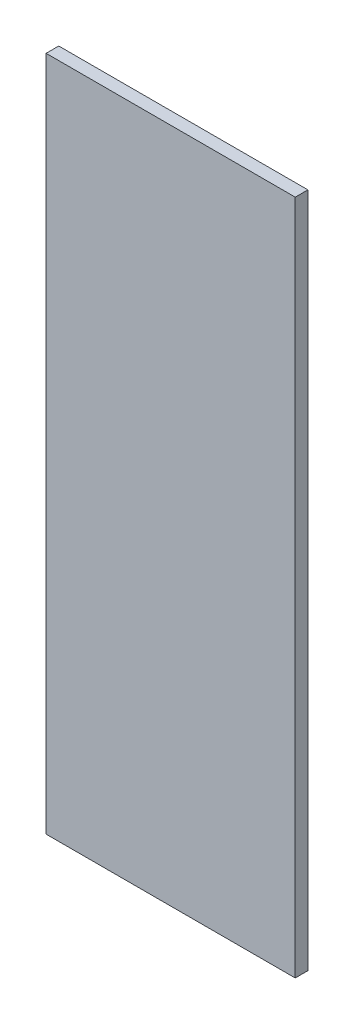
ISO-10303-21;
HEADER;
FILE_DESCRIPTION(('STEP AP214'),'2;1');
FILE_NAME('part.step','',(''),(''),'','','');
FILE_SCHEMA(('AUTOMOTIVE_DESIGN { 1 0 10303 214 1 1 1 1 }'));
ENDSEC;
DATA;
#1=APPLICATION_CONTEXT('core data for automotive mechanical design processes');
#2=APPLICATION_PROTOCOL_DEFINITION('international standard','automotive_design',2000,#1);
#3=PRODUCT_CONTEXT('',#1,'mechanical');
#4=PRODUCT('Part','Part','',(#3));
#5=PRODUCT_RELATED_PRODUCT_CATEGORY('part','',(#4));
#6=PRODUCT_DEFINITION_FORMATION('','',#4);
#7=PRODUCT_DEFINITION_CONTEXT('part definition',#1,'design');
#8=PRODUCT_DEFINITION('design','',#6,#7);
#9=PRODUCT_DEFINITION_SHAPE('','',#8);
#10=(LENGTH_UNIT() NAMED_UNIT(*) SI_UNIT(.MILLI.,.METRE.));
#11=(NAMED_UNIT(*) PLANE_ANGLE_UNIT() SI_UNIT($,.RADIAN.));
#12=(NAMED_UNIT(*) SI_UNIT($,.STERADIAN.) SOLID_ANGLE_UNIT());
#13=UNCERTAINTY_MEASURE_WITH_UNIT(LENGTH_MEASURE(1.E-05),#10,'distance_accuracy_value','');
#14=(GEOMETRIC_REPRESENTATION_CONTEXT(3) GLOBAL_UNCERTAINTY_ASSIGNED_CONTEXT((#13)) GLOBAL_UNIT_ASSIGNED_CONTEXT((#10,
#11,#12)) REPRESENTATION_CONTEXT('',''));
#15=CARTESIAN_POINT('',(0.,0.,0.));
#16=DIRECTION('',(0.,0.,1.));
#17=DIRECTION('',(1.,0.,0.));
#18=AXIS2_PLACEMENT_3D('',#15,#16,#17);
#19=CARTESIAN_POINT('',(91.6920013427734,76.5279998779297,0.));
#20=DIRECTION('',(1.,0.,0.));
#21=DIRECTION('',(0.,-1.,0.));
#22=AXIS2_PLACEMENT_3D('',#19,#20,#21);
#23=PLANE('',#22);
#24=DIRECTION('',(0.,-1.,0.));
#25=VECTOR('',#24,1.);
#26=CARTESIAN_POINT('',(91.6920013427734,76.5279998779297,0.03556));
#27=LINE('',#26,#25);
#28=CARTESIAN_POINT('',(91.6920013427734,76.5279998779297,0.03556));
#29=VERTEX_POINT('',#28);
#30=CARTESIAN_POINT('',(91.6920013427734,74.6279983520508,0.03556));
#31=VERTEX_POINT('',#30);
#32=EDGE_CURVE('E11',#29,#31,#27,.T.);
#33=ORIENTED_EDGE('',*,*,#32,.F.);
#34=DIRECTION('',(0.,0.,1.));
#35=VECTOR('',#34,1.);
#36=CARTESIAN_POINT('',(91.6920013427734,76.5279998779297,0.));
#37=LINE('',#36,#35);
#38=CARTESIAN_POINT('',(91.6920013427734,76.5279998779297,0.));
#39=VERTEX_POINT('',#38);
#40=EDGE_CURVE('E24',#39,#29,#37,.T.);
#41=ORIENTED_EDGE('',*,*,#40,.F.);
#42=DIRECTION('',(0.,-1.,0.));
#43=VECTOR('',#42,1.);
#44=CARTESIAN_POINT('',(91.6920013427734,76.5279998779297,0.));
#45=LINE('',#44,#43);
#46=CARTESIAN_POINT('',(91.6920013427734,74.6279983520508,0.));
#47=VERTEX_POINT('',#46);
#48=EDGE_CURVE('E75',#39,#47,#45,.T.);
#49=ORIENTED_EDGE('',*,*,#48,.T.);
#50=DIRECTION('',(0.,0.,1.));
#51=VECTOR('',#50,1.);
#52=CARTESIAN_POINT('',(91.6920013427734,74.6279983520508,0.));
#53=LINE('',#52,#51);
#54=EDGE_CURVE('E37',#47,#31,#53,.T.);
#55=ORIENTED_EDGE('',*,*,#54,.T.);
#56=EDGE_LOOP('',(#33,#41,#49,#55));
#57=FACE_BOUND('',#56,.T.);
#58=ADVANCED_FACE('F17',(#57),#23,.F.);
#59=CARTESIAN_POINT('',(91.6920013427734,74.6279983520508,0.));
#60=DIRECTION('',(0.,1.,0.));
#61=DIRECTION('',(1.,0.,0.));
#62=AXIS2_PLACEMENT_3D('',#59,#60,#61);
#63=PLANE('',#62);
#64=DIRECTION('',(1.,0.,0.));
#65=VECTOR('',#64,1.);
#66=CARTESIAN_POINT('',(91.6920013427734,74.6279983520508,0.03556));
#67=LINE('',#66,#65);
#68=CARTESIAN_POINT('',(92.3919982910156,74.6279983520508,0.03556));
#69=VERTEX_POINT('',#68);
#70=EDGE_CURVE('E83',#31,#69,#67,.T.);
#71=ORIENTED_EDGE('',*,*,#70,.F.);
#72=ORIENTED_EDGE('',*,*,#54,.F.);
#73=DIRECTION('',(1.,0.,0.));
#74=VECTOR('',#73,1.);
#75=CARTESIAN_POINT('',(91.6920013427734,74.6279983520508,0.));
#76=LINE('',#75,#74);
#77=CARTESIAN_POINT('',(92.3919982910156,74.6279983520508,0.));
#78=VERTEX_POINT('',#77);
#79=EDGE_CURVE('E81',#47,#78,#76,.T.);
#80=ORIENTED_EDGE('',*,*,#79,.T.);
#81=DIRECTION('',(0.,0.,1.));
#82=VECTOR('',#81,1.);
#83=CARTESIAN_POINT('',(92.3919982910156,74.6279983520508,0.));
#84=LINE('',#83,#82);
#85=EDGE_CURVE('E67',#78,#69,#84,.T.);
#86=ORIENTED_EDGE('',*,*,#85,.T.);
#87=EDGE_LOOP('',(#71,#72,#80,#86));
#88=FACE_BOUND('',#87,.T.);
#89=ADVANCED_FACE('F89',(#88),#63,.F.);
#90=CARTESIAN_POINT('',(92.3919982910156,74.6279983520508,0.));
#91=DIRECTION('',(-1.,0.,0.));
#92=DIRECTION('',(0.,1.,0.));
#93=AXIS2_PLACEMENT_3D('',#90,#91,#92);
#94=PLANE('',#93);
#95=DIRECTION('',(0.,1.,0.));
#96=VECTOR('',#95,1.);
#97=CARTESIAN_POINT('',(92.3919982910156,74.6279983520508,0.03556));
#98=LINE('',#97,#96);
#99=CARTESIAN_POINT('',(92.3919982910156,76.5279998779297,0.03556));
#100=VERTEX_POINT('',#99);
#101=EDGE_CURVE('E71',#69,#100,#98,.T.);
#102=ORIENTED_EDGE('',*,*,#101,.F.);
#103=ORIENTED_EDGE('',*,*,#85,.F.);
#104=DIRECTION('',(0.,1.,0.));
#105=VECTOR('',#104,1.);
#106=CARTESIAN_POINT('',(92.3919982910156,74.6279983520508,0.));
#107=LINE('',#106,#105);
#108=CARTESIAN_POINT('',(92.3919982910156,76.5279998779297,0.));
#109=VERTEX_POINT('',#108);
#110=EDGE_CURVE('E63',#78,#109,#107,.T.);
#111=ORIENTED_EDGE('',*,*,#110,.T.);
#112=DIRECTION('',(0.,0.,1.));
#113=VECTOR('',#112,1.);
#114=CARTESIAN_POINT('',(92.3919982910156,76.5279998779297,0.));
#115=LINE('',#114,#113);
#116=EDGE_CURVE('E53',#109,#100,#115,.T.);
#117=ORIENTED_EDGE('',*,*,#116,.T.);
#118=EDGE_LOOP('',(#102,#103,#111,#117));
#119=FACE_BOUND('',#118,.T.);
#120=ADVANCED_FACE('F66',(#119),#94,.F.);
#121=CARTESIAN_POINT('',(92.3919982910156,76.5279998779297,0.));
#122=DIRECTION('',(0.,-1.,0.));
#123=DIRECTION('',(-1.,0.,0.));
#124=AXIS2_PLACEMENT_3D('',#121,#122,#123);
#125=PLANE('',#124);
#126=DIRECTION('',(-1.,0.,0.));
#127=VECTOR('',#126,1.);
#128=CARTESIAN_POINT('',(92.3919982910156,76.5279998779297,0.03556));
#129=LINE('',#128,#127);
#130=EDGE_CURVE('E59',#100,#29,#129,.T.);
#131=ORIENTED_EDGE('',*,*,#130,.F.);
#132=ORIENTED_EDGE('',*,*,#116,.F.);
#133=DIRECTION('',(-1.,0.,0.));
#134=VECTOR('',#133,1.);
#135=CARTESIAN_POINT('',(92.3919982910156,76.5279998779297,0.));
#136=LINE('',#135,#134);
#137=EDGE_CURVE('E57',#109,#39,#136,.T.);
#138=ORIENTED_EDGE('',*,*,#137,.T.);
#139=ORIENTED_EDGE('',*,*,#40,.T.);
#140=EDGE_LOOP('',(#131,#132,#138,#139));
#141=FACE_BOUND('',#140,.T.);
#142=ADVANCED_FACE('F55',(#141),#125,.F.);
#143=CARTESIAN_POINT('',(91.6920013427734,76.5279998779297,0.));
#144=DIRECTION('',(0.,0.,-1.));
#145=DIRECTION('',(-1.,0.,0.));
#146=AXIS2_PLACEMENT_3D('',#143,#144,#145);
#147=PLANE('',#146);
#148=ORIENTED_EDGE('',*,*,#137,.F.);
#149=ORIENTED_EDGE('',*,*,#110,.F.);
#150=ORIENTED_EDGE('',*,*,#79,.F.);
#151=ORIENTED_EDGE('',*,*,#48,.F.);
#152=EDGE_LOOP('',(#148,#149,#150,#151));
#153=FACE_BOUND('',#152,.T.);
#154=ADVANCED_FACE('F74',(#153),#147,.T.);
#155=CARTESIAN_POINT('',(91.6920013427734,76.5279998779297,0.03556));
#156=DIRECTION('',(0.,0.,-1.));
#157=DIRECTION('',(-1.,0.,0.));
#158=AXIS2_PLACEMENT_3D('',#155,#156,#157);
#159=PLANE('',#158);
#160=ORIENTED_EDGE('',*,*,#32,.T.);
#161=ORIENTED_EDGE('',*,*,#70,.T.);
#162=ORIENTED_EDGE('',*,*,#101,.T.);
#163=ORIENTED_EDGE('',*,*,#130,.T.);
#164=EDGE_LOOP('',(#160,#161,#162,#163));
#165=FACE_BOUND('',#164,.T.);
#166=ADVANCED_FACE('F91',(#165),#159,.F.);
#167=CLOSED_SHELL('',(#58,#89,#120,#142,#154,#166));
#168=MANIFOLD_SOLID_BREP('B1',#167);
#169=ADVANCED_BREP_SHAPE_REPRESENTATION('',(#18,#168),#14);
#170=SHAPE_DEFINITION_REPRESENTATION(#9,#169);
ENDSEC;
END-ISO-10303-21;
